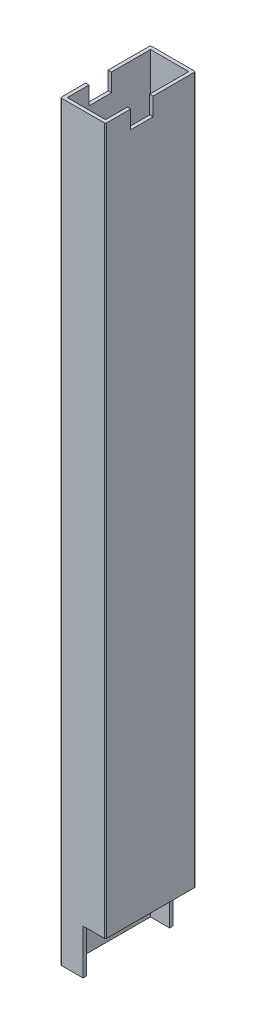
ISO-10303-21;
HEADER;
FILE_DESCRIPTION(('STEP AP214'),'2;1');
FILE_NAME('part.step','',(''),(''),'','','');
FILE_SCHEMA(('AUTOMOTIVE_DESIGN { 1 0 10303 214 1 1 1 1 }'));
ENDSEC;
DATA;
#1=APPLICATION_CONTEXT('core data for automotive mechanical design processes');
#2=APPLICATION_PROTOCOL_DEFINITION('international standard','automotive_design',2000,#1);
#3=PRODUCT_CONTEXT('',#1,'mechanical');
#4=PRODUCT('Part','Part','',(#3));
#5=PRODUCT_RELATED_PRODUCT_CATEGORY('part','',(#4));
#6=PRODUCT_DEFINITION_FORMATION('','',#4);
#7=PRODUCT_DEFINITION_CONTEXT('part definition',#1,'design');
#8=PRODUCT_DEFINITION('design','',#6,#7);
#9=PRODUCT_DEFINITION_SHAPE('','',#8);
#10=(LENGTH_UNIT() NAMED_UNIT(*) SI_UNIT(.MILLI.,.METRE.));
#11=(NAMED_UNIT(*) PLANE_ANGLE_UNIT() SI_UNIT($,.RADIAN.));
#12=(NAMED_UNIT(*) SI_UNIT($,.STERADIAN.) SOLID_ANGLE_UNIT());
#13=UNCERTAINTY_MEASURE_WITH_UNIT(LENGTH_MEASURE(1.E-05),#10,'distance_accuracy_value','');
#14=(GEOMETRIC_REPRESENTATION_CONTEXT(3) GLOBAL_UNCERTAINTY_ASSIGNED_CONTEXT((#13)) GLOBAL_UNIT_ASSIGNED_CONTEXT((#10,
#11,#12)) REPRESENTATION_CONTEXT('',''));
#15=CARTESIAN_POINT('',(0.,0.,0.));
#16=DIRECTION('',(0.,0.,1.));
#17=DIRECTION('',(1.,0.,0.));
#18=AXIS2_PLACEMENT_3D('',#15,#16,#17);
#19=CARTESIAN_POINT('',(19.5,334.,-0.5));
#20=DIRECTION('',(0.,1.,0.));
#21=DIRECTION('',(0.,0.,1.));
#22=AXIS2_PLACEMENT_3D('',#19,#20,#21);
#23=PLANE('',#22);
#24=DIRECTION('',(1.,0.,0.));
#25=VECTOR('',#24,1.);
#26=CARTESIAN_POINT('',(0.,334.,-11.16));
#27=LINE('',#26,#25);
#28=CARTESIAN_POINT('',(0.,334.,-11.16));
#29=VERTEX_POINT('',#28);
#30=CARTESIAN_POINT('',(1.5,334.,-11.16));
#31=VERTEX_POINT('',#30);
#32=EDGE_CURVE('E238',#29,#31,#27,.T.);
#33=ORIENTED_EDGE('',*,*,#32,.F.);
#34=DIRECTION('',(0.,0.,1.));
#35=VECTOR('',#34,1.);
#36=CARTESIAN_POINT('',(0.,334.,-0.500000000000004));
#37=LINE('',#36,#35);
#38=CARTESIAN_POINT('',(0.,334.,-0.500000000000003));
#39=VERTEX_POINT('',#38);
#40=EDGE_CURVE('E222',#29,#39,#37,.T.);
#41=ORIENTED_EDGE('',*,*,#40,.T.);
#42=CARTESIAN_POINT('',(0.5,334.,-0.5));
#43=DIRECTION('',(0.,1.,0.));
#44=DIRECTION('',(0.,0.,-1.));
#45=AXIS2_PLACEMENT_3D('',#42,#43,#44);
#46=CIRCLE('',#45,0.5);
#47=CARTESIAN_POINT('',(0.500000000000004,334.,0.));
#48=VERTEX_POINT('',#47);
#49=EDGE_CURVE('E369',#39,#48,#46,.T.);
#50=ORIENTED_EDGE('',*,*,#49,.T.);
#51=DIRECTION('',(1.,0.,0.));
#52=VECTOR('',#51,1.);
#53=CARTESIAN_POINT('',(0.500000000000004,334.,0.));
#54=LINE('',#53,#52);
#55=CARTESIAN_POINT('',(19.5,334.,0.));
#56=VERTEX_POINT('',#55);
#57=EDGE_CURVE('E372',#48,#56,#54,.T.);
#58=ORIENTED_EDGE('',*,*,#57,.T.);
#59=CARTESIAN_POINT('',(19.5,334.,-0.5));
#60=DIRECTION('',(0.,1.,0.));
#61=DIRECTION('',(0.,0.,1.));
#62=AXIS2_PLACEMENT_3D('',#59,#60,#61);
#63=CIRCLE('',#62,0.5);
#64=CARTESIAN_POINT('',(20.,334.,-0.5));
#65=VERTEX_POINT('',#64);
#66=EDGE_CURVE('E346',#56,#65,#63,.T.);
#67=ORIENTED_EDGE('',*,*,#66,.T.);
#68=DIRECTION('',(0.,0.,-1.));
#69=VECTOR('',#68,1.);
#70=CARTESIAN_POINT('',(20.,334.,-0.5));
#71=LINE('',#70,#69);
#72=CARTESIAN_POINT('',(20.,334.,-11.16));
#73=VERTEX_POINT('',#72);
#74=EDGE_CURVE('E352',#65,#73,#71,.T.);
#75=ORIENTED_EDGE('',*,*,#74,.T.);
#76=CARTESIAN_POINT('',(18.5,334.,-11.16));
#77=VERTEX_POINT('',#76);
#78=EDGE_CURVE('E242',#77,#73,#27,.T.);
#79=ORIENTED_EDGE('',*,*,#78,.F.);
#80=DIRECTION('',(0.,0.,-1.));
#81=VECTOR('',#80,1.);
#82=CARTESIAN_POINT('',(18.5,334.,-1.5));
#83=LINE('',#82,#81);
#84=CARTESIAN_POINT('',(18.5,334.,-1.5));
#85=VERTEX_POINT('',#84);
#86=EDGE_CURVE('E312',#85,#77,#83,.T.);
#87=ORIENTED_EDGE('',*,*,#86,.F.);
#88=DIRECTION('',(1.,0.,0.));
#89=VECTOR('',#88,1.);
#90=CARTESIAN_POINT('',(1.5,334.,-1.5));
#91=LINE('',#90,#89);
#92=CARTESIAN_POINT('',(1.5,334.,-1.5));
#93=VERTEX_POINT('',#92);
#94=EDGE_CURVE('E307',#93,#85,#91,.T.);
#95=ORIENTED_EDGE('',*,*,#94,.F.);
#96=DIRECTION('',(0.,0.,1.));
#97=VECTOR('',#96,1.);
#98=CARTESIAN_POINT('',(1.5,334.,-1.5));
#99=LINE('',#98,#97);
#100=EDGE_CURVE('E308',#31,#93,#99,.T.);
#101=ORIENTED_EDGE('',*,*,#100,.F.);
#102=EDGE_LOOP('',(#33,#41,#50,#58,#67,#75,#79,#87,#95,#101));
#103=FACE_BOUND('',#102,.T.);
#104=ADVANCED_FACE('F39',(#103),#23,.T.);
#105=DIRECTION('',(1.,0.,0.));
#106=VECTOR('',#105,1.);
#107=CARTESIAN_POINT('',(0.,334.,-21.16));
#108=LINE('',#107,#106);
#109=CARTESIAN_POINT('',(18.5,334.,-21.16));
#110=VERTEX_POINT('',#109);
#111=CARTESIAN_POINT('',(20.,334.,-21.16));
#112=VERTEX_POINT('',#111);
#113=EDGE_CURVE('E247',#110,#112,#108,.T.);
#114=ORIENTED_EDGE('',*,*,#113,.T.);
#115=CARTESIAN_POINT('',(20.,334.,-39.5));
#116=VERTEX_POINT('',#115);
#117=EDGE_CURVE('E350',#112,#116,#71,.T.);
#118=ORIENTED_EDGE('',*,*,#117,.T.);
#119=CARTESIAN_POINT('',(19.5,334.,-39.5));
#120=DIRECTION('',(0.,1.,0.));
#121=DIRECTION('',(0.,0.,-1.));
#122=AXIS2_PLACEMENT_3D('',#119,#120,#121);
#123=CIRCLE('',#122,0.5);
#124=CARTESIAN_POINT('',(19.5,334.,-40.));
#125=VERTEX_POINT('',#124);
#126=EDGE_CURVE('E356',#116,#125,#123,.T.);
#127=ORIENTED_EDGE('',*,*,#126,.T.);
#128=DIRECTION('',(-1.,0.,0.));
#129=VECTOR('',#128,1.);
#130=CARTESIAN_POINT('',(0.500000000000004,334.,-40.));
#131=LINE('',#130,#129);
#132=CARTESIAN_POINT('',(0.5,334.,-40.));
#133=VERTEX_POINT('',#132);
#134=EDGE_CURVE('E359',#125,#133,#131,.T.);
#135=ORIENTED_EDGE('',*,*,#134,.T.);
#136=CARTESIAN_POINT('',(0.5,334.,-39.5));
#137=DIRECTION('',(0.,1.,0.));
#138=DIRECTION('',(0.,0.,-1.));
#139=AXIS2_PLACEMENT_3D('',#136,#137,#138);
#140=CIRCLE('',#139,0.5);
#141=CARTESIAN_POINT('',(0.,334.,-39.5));
#142=VERTEX_POINT('',#141);
#143=EDGE_CURVE('E362',#133,#142,#140,.T.);
#144=ORIENTED_EDGE('',*,*,#143,.T.);
#145=CARTESIAN_POINT('',(0.,334.,-21.16));
#146=VERTEX_POINT('',#145);
#147=EDGE_CURVE('E365',#142,#146,#37,.T.);
#148=ORIENTED_EDGE('',*,*,#147,.T.);
#149=CARTESIAN_POINT('',(1.5,334.,-21.16));
#150=VERTEX_POINT('',#149);
#151=EDGE_CURVE('E243',#146,#150,#108,.T.);
#152=ORIENTED_EDGE('',*,*,#151,.T.);
#153=CARTESIAN_POINT('',(1.5,334.,-38.5));
#154=VERTEX_POINT('',#153);
#155=EDGE_CURVE('E303',#154,#150,#99,.T.);
#156=ORIENTED_EDGE('',*,*,#155,.F.);
#157=DIRECTION('',(-1.,0.,0.));
#158=VECTOR('',#157,1.);
#159=CARTESIAN_POINT('',(1.5,334.,-38.5));
#160=LINE('',#159,#158);
#161=CARTESIAN_POINT('',(18.5,334.,-38.5));
#162=VERTEX_POINT('',#161);
#163=EDGE_CURVE('E316',#162,#154,#160,.T.);
#164=ORIENTED_EDGE('',*,*,#163,.F.);
#165=EDGE_CURVE('E311',#110,#162,#83,.T.);
#166=ORIENTED_EDGE('',*,*,#165,.F.);
#167=EDGE_LOOP('',(#114,#118,#127,#135,#144,#148,#152,#156,#164,#166));
#168=FACE_BOUND('',#167,.T.);
#169=ADVANCED_FACE('F481',(#168),#23,.T.);
#170=CARTESIAN_POINT('',(19.5,0.,-0.5));
#171=DIRECTION('',(0.,1.,0.));
#172=DIRECTION('',(0.,0.,1.));
#173=AXIS2_PLACEMENT_3D('',#170,#171,#172);
#174=PLANE('',#173);
#175=DIRECTION('',(-1.,0.,0.));
#176=VECTOR('',#175,1.);
#177=CARTESIAN_POINT('',(0.500000000000004,0.,-40.));
#178=LINE('',#177,#176);
#179=CARTESIAN_POINT('',(10.,0.,-40.));
#180=VERTEX_POINT('',#179);
#181=CARTESIAN_POINT('',(0.5,0.,-40.));
#182=VERTEX_POINT('',#181);
#183=EDGE_CURVE('E345',#180,#182,#178,.T.);
#184=ORIENTED_EDGE('',*,*,#183,.F.);
#185=DIRECTION('',(0.,0.,1.));
#186=VECTOR('',#185,1.);
#187=CARTESIAN_POINT('',(10.,0.,-40.));
#188=LINE('',#187,#186);
#189=CARTESIAN_POINT('',(10.,0.,-38.5));
#190=VERTEX_POINT('',#189);
#191=EDGE_CURVE('E273',#180,#190,#188,.T.);
#192=ORIENTED_EDGE('',*,*,#191,.T.);
#193=DIRECTION('',(-1.,0.,0.));
#194=VECTOR('',#193,1.);
#195=CARTESIAN_POINT('',(1.5,0.,-38.5));
#196=LINE('',#195,#194);
#197=CARTESIAN_POINT('',(1.5,0.,-38.5));
#198=VERTEX_POINT('',#197);
#199=EDGE_CURVE('E327',#190,#198,#196,.T.);
#200=ORIENTED_EDGE('',*,*,#199,.T.);
#201=DIRECTION('',(0.,0.,1.));
#202=VECTOR('',#201,1.);
#203=CARTESIAN_POINT('',(1.5,0.,-1.5));
#204=LINE('',#203,#202);
#205=CARTESIAN_POINT('',(1.5,0.,-1.5));
#206=VERTEX_POINT('',#205);
#207=EDGE_CURVE('E302',#198,#206,#204,.T.);
#208=ORIENTED_EDGE('',*,*,#207,.T.);
#209=DIRECTION('',(1.,0.,0.));
#210=VECTOR('',#209,1.);
#211=CARTESIAN_POINT('',(1.5,0.,-1.5));
#212=LINE('',#211,#210);
#213=CARTESIAN_POINT('',(10.,0.,-1.5));
#214=VERTEX_POINT('',#213);
#215=EDGE_CURVE('E323',#206,#214,#212,.T.);
#216=ORIENTED_EDGE('',*,*,#215,.T.);
#217=CARTESIAN_POINT('',(10.,0.,0.));
#218=VERTEX_POINT('',#217);
#219=EDGE_CURVE('E278',#214,#218,#188,.T.);
#220=ORIENTED_EDGE('',*,*,#219,.T.);
#221=DIRECTION('',(1.,0.,0.));
#222=VECTOR('',#221,1.);
#223=CARTESIAN_POINT('',(0.500000000000004,0.,0.));
#224=LINE('',#223,#222);
#225=CARTESIAN_POINT('',(0.500000000000004,0.,0.));
#226=VERTEX_POINT('',#225);
#227=EDGE_CURVE('E351',#226,#218,#224,.T.);
#228=ORIENTED_EDGE('',*,*,#227,.F.);
#229=CARTESIAN_POINT('',(0.5,0.,-0.5));
#230=DIRECTION('',(0.,1.,0.));
#231=DIRECTION('',(0.,0.,-1.));
#232=AXIS2_PLACEMENT_3D('',#229,#230,#231);
#233=CIRCLE('',#232,0.5);
#234=CARTESIAN_POINT('',(0.,0.,-0.500000000000003));
#235=VERTEX_POINT('',#234);
#236=EDGE_CURVE('E384',#235,#226,#233,.T.);
#237=ORIENTED_EDGE('',*,*,#236,.F.);
#238=DIRECTION('',(0.,0.,1.));
#239=VECTOR('',#238,1.);
#240=CARTESIAN_POINT('',(0.,0.,-0.500000000000004));
#241=LINE('',#240,#239);
#242=CARTESIAN_POINT('',(0.,0.,-39.5));
#243=VERTEX_POINT('',#242);
#244=EDGE_CURVE('E381',#243,#235,#241,.T.);
#245=ORIENTED_EDGE('',*,*,#244,.F.);
#246=CARTESIAN_POINT('',(0.5,0.,-39.5));
#247=DIRECTION('',(0.,1.,0.));
#248=DIRECTION('',(0.,0.,-1.));
#249=AXIS2_PLACEMENT_3D('',#246,#247,#248);
#250=CIRCLE('',#249,0.5);
#251=EDGE_CURVE('E378',#182,#243,#250,.T.);
#252=ORIENTED_EDGE('',*,*,#251,.F.);
#253=EDGE_LOOP('',(#184,#192,#200,#208,#216,#220,#228,#237,#245,#252));
#254=FACE_BOUND('',#253,.T.);
#255=ADVANCED_FACE('F518',(#254),#174,.F.);
#256=CARTESIAN_POINT('',(19.5,334.,-0.5));
#257=DIRECTION('',(0.,-1.,0.));
#258=DIRECTION('',(0.,0.,-1.));
#259=AXIS2_PLACEMENT_3D('',#256,#257,#258);
#260=CYLINDRICAL_SURFACE('',#259,0.5);
#261=DIRECTION('',(0.,-1.,0.));
#262=VECTOR('',#261,1.);
#263=CARTESIAN_POINT('',(19.5,334.,0.));
#264=LINE('',#263,#262);
#265=CARTESIAN_POINT('',(19.5,20.,0.));
#266=VERTEX_POINT('',#265);
#267=EDGE_CURVE('E375',#56,#266,#264,.T.);
#268=ORIENTED_EDGE('',*,*,#267,.T.);
#269=CARTESIAN_POINT('',(19.5,20.,-0.5));
#270=DIRECTION('',(0.,1.,0.));
#271=DIRECTION('',(0.,0.,1.));
#272=AXIS2_PLACEMENT_3D('',#269,#270,#271);
#273=CIRCLE('',#272,0.5);
#274=CARTESIAN_POINT('',(20.,20.,-0.5));
#275=VERTEX_POINT('',#274);
#276=EDGE_CURVE('E295',#266,#275,#273,.T.);
#277=ORIENTED_EDGE('',*,*,#276,.T.);
#278=DIRECTION('',(0.,-1.,0.));
#279=VECTOR('',#278,1.);
#280=CARTESIAN_POINT('',(20.,334.,-0.5));
#281=LINE('',#280,#279);
#282=EDGE_CURVE('E417',#65,#275,#281,.T.);
#283=ORIENTED_EDGE('',*,*,#282,.F.);
#284=ORIENTED_EDGE('',*,*,#66,.F.);
#285=EDGE_LOOP('',(#268,#277,#283,#284));
#286=FACE_BOUND('',#285,.T.);
#287=ADVANCED_FACE('F41',(#286),#260,.T.);
#288=CARTESIAN_POINT('',(20.,334.,-0.5));
#289=DIRECTION('',(-1.,0.,0.));
#290=DIRECTION('',(0.,0.,1.));
#291=AXIS2_PLACEMENT_3D('',#288,#289,#290);
#292=PLANE('',#291);
#293=DIRECTION('',(0.,0.,-1.));
#294=VECTOR('',#293,1.);
#295=CARTESIAN_POINT('',(20.,326.,-11.16));
#296=LINE('',#295,#294);
#297=CARTESIAN_POINT('',(20.,326.,-11.16));
#298=VERTEX_POINT('',#297);
#299=CARTESIAN_POINT('',(20.,326.,-21.16));
#300=VERTEX_POINT('',#299);
#301=EDGE_CURVE('E227',#298,#300,#296,.T.);
#302=ORIENTED_EDGE('',*,*,#301,.F.);
#303=DIRECTION('',(0.,-1.,0.));
#304=VECTOR('',#303,1.);
#305=CARTESIAN_POINT('',(20.,334.,-11.16));
#306=LINE('',#305,#304);
#307=EDGE_CURVE('E232',#73,#298,#306,.T.);
#308=ORIENTED_EDGE('',*,*,#307,.F.);
#309=ORIENTED_EDGE('',*,*,#74,.F.);
#310=ORIENTED_EDGE('',*,*,#282,.T.);
#311=DIRECTION('',(0.,0.,1.));
#312=VECTOR('',#311,1.);
#313=CARTESIAN_POINT('',(20.,20.,-40.));
#314=LINE('',#313,#312);
#315=CARTESIAN_POINT('',(20.,20.,-39.5));
#316=VERTEX_POINT('',#315);
#317=EDGE_CURVE('E267',#316,#275,#314,.T.);
#318=ORIENTED_EDGE('',*,*,#317,.F.);
#319=DIRECTION('',(0.,-1.,0.));
#320=VECTOR('',#319,1.);
#321=CARTESIAN_POINT('',(20.,334.,-39.5));
#322=LINE('',#321,#320);
#323=EDGE_CURVE('E413',#116,#316,#322,.T.);
#324=ORIENTED_EDGE('',*,*,#323,.F.);
#325=ORIENTED_EDGE('',*,*,#117,.F.);
#326=DIRECTION('',(0.,1.,0.));
#327=VECTOR('',#326,1.);
#328=CARTESIAN_POINT('',(20.,334.,-21.16));
#329=LINE('',#328,#327);
#330=EDGE_CURVE('E224',#300,#112,#329,.T.);
#331=ORIENTED_EDGE('',*,*,#330,.F.);
#332=EDGE_LOOP('',(#302,#308,#309,#310,#318,#324,#325,#331));
#333=FACE_BOUND('',#332,.T.);
#334=ADVANCED_FACE('F476',(#333),#292,.F.);
#335=CARTESIAN_POINT('',(19.5,334.,-39.5));
#336=DIRECTION('',(0.,-1.,0.));
#337=DIRECTION('',(0.,0.,-1.));
#338=AXIS2_PLACEMENT_3D('',#335,#336,#337);
#339=CYLINDRICAL_SURFACE('',#338,0.5);
#340=ORIENTED_EDGE('',*,*,#323,.T.);
#341=CARTESIAN_POINT('',(19.5,20.,-39.5));
#342=DIRECTION('',(0.,1.,0.));
#343=DIRECTION('',(0.,0.,1.));
#344=AXIS2_PLACEMENT_3D('',#341,#342,#343);
#345=CIRCLE('',#344,0.5);
#346=CARTESIAN_POINT('',(19.5,20.,-40.));
#347=VERTEX_POINT('',#346);
#348=EDGE_CURVE('E291',#316,#347,#345,.T.);
#349=ORIENTED_EDGE('',*,*,#348,.T.);
#350=DIRECTION('',(0.,-1.,0.));
#351=VECTOR('',#350,1.);
#352=CARTESIAN_POINT('',(19.5,334.,-40.));
#353=LINE('',#352,#351);
#354=EDGE_CURVE('E409',#125,#347,#353,.T.);
#355=ORIENTED_EDGE('',*,*,#354,.F.);
#356=ORIENTED_EDGE('',*,*,#126,.F.);
#357=EDGE_LOOP('',(#340,#349,#355,#356));
#358=FACE_BOUND('',#357,.T.);
#359=ADVANCED_FACE('F503',(#358),#339,.T.);
#360=CARTESIAN_POINT('',(0.500000000000004,334.,-40.));
#361=DIRECTION('',(0.,0.,1.));
#362=DIRECTION('',(1.,0.,0.));
#363=AXIS2_PLACEMENT_3D('',#360,#361,#362);
#364=PLANE('',#363);
#365=DIRECTION('',(-1.,0.,0.));
#366=VECTOR('',#365,1.);
#367=CARTESIAN_POINT('',(20.,20.,-40.));
#368=LINE('',#367,#366);
#369=CARTESIAN_POINT('',(10.,20.,-40.));
#370=VERTEX_POINT('',#369);
#371=EDGE_CURVE('E258',#347,#370,#368,.T.);
#372=ORIENTED_EDGE('',*,*,#371,.T.);
#373=DIRECTION('',(0.,-1.,0.));
#374=VECTOR('',#373,1.);
#375=CARTESIAN_POINT('',(10.,20.,-40.));
#376=LINE('',#375,#374);
#377=EDGE_CURVE('E262',#370,#180,#376,.T.);
#378=ORIENTED_EDGE('',*,*,#377,.T.);
#379=ORIENTED_EDGE('',*,*,#183,.T.);
#380=DIRECTION('',(0.,-1.,0.));
#381=VECTOR('',#380,1.);
#382=CARTESIAN_POINT('',(0.5,334.,-40.));
#383=LINE('',#382,#381);
#384=EDGE_CURVE('E405',#133,#182,#383,.T.);
#385=ORIENTED_EDGE('',*,*,#384,.F.);
#386=ORIENTED_EDGE('',*,*,#134,.F.);
#387=ORIENTED_EDGE('',*,*,#354,.T.);
#388=EDGE_LOOP('',(#372,#378,#379,#385,#386,#387));
#389=FACE_BOUND('',#388,.T.);
#390=ADVANCED_FACE('F499',(#389),#364,.F.);
#391=CARTESIAN_POINT('',(0.5,334.,-39.5));
#392=DIRECTION('',(0.,-1.,0.));
#393=DIRECTION('',(0.,0.,-1.));
#394=AXIS2_PLACEMENT_3D('',#391,#392,#393);
#395=CYLINDRICAL_SURFACE('',#394,0.5);
#396=ORIENTED_EDGE('',*,*,#251,.T.);
#397=DIRECTION('',(0.,-1.,0.));
#398=VECTOR('',#397,1.);
#399=CARTESIAN_POINT('',(0.,334.,-39.5));
#400=LINE('',#399,#398);
#401=EDGE_CURVE('E401',#142,#243,#400,.T.);
#402=ORIENTED_EDGE('',*,*,#401,.F.);
#403=ORIENTED_EDGE('',*,*,#143,.F.);
#404=ORIENTED_EDGE('',*,*,#384,.T.);
#405=EDGE_LOOP('',(#396,#402,#403,#404));
#406=FACE_BOUND('',#405,.T.);
#407=ADVANCED_FACE('F510',(#406),#395,.T.);
#408=CARTESIAN_POINT('',(0.,334.,-0.500000000000004));
#409=DIRECTION('',(1.,0.,0.));
#410=DIRECTION('',(0.,0.,-1.));
#411=AXIS2_PLACEMENT_3D('',#408,#409,#410);
#412=PLANE('',#411);
#413=ORIENTED_EDGE('',*,*,#40,.F.);
#414=DIRECTION('',(0.,-1.,0.));
#415=VECTOR('',#414,1.);
#416=CARTESIAN_POINT('',(0.,334.,-11.16));
#417=LINE('',#416,#415);
#418=CARTESIAN_POINT('',(0.,326.,-11.16));
#419=VERTEX_POINT('',#418);
#420=EDGE_CURVE('E200',#29,#419,#417,.T.);
#421=ORIENTED_EDGE('',*,*,#420,.T.);
#422=DIRECTION('',(0.,0.,-1.));
#423=VECTOR('',#422,1.);
#424=CARTESIAN_POINT('',(0.,326.,-11.16));
#425=LINE('',#424,#423);
#426=CARTESIAN_POINT('',(0.,326.,-21.16));
#427=VERTEX_POINT('',#426);
#428=EDGE_CURVE('E209',#419,#427,#425,.T.);
#429=ORIENTED_EDGE('',*,*,#428,.T.);
#430=DIRECTION('',(0.,1.,0.));
#431=VECTOR('',#430,1.);
#432=CARTESIAN_POINT('',(0.,334.,-21.16));
#433=LINE('',#432,#431);
#434=EDGE_CURVE('E217',#427,#146,#433,.T.);
#435=ORIENTED_EDGE('',*,*,#434,.T.);
#436=ORIENTED_EDGE('',*,*,#147,.F.);
#437=ORIENTED_EDGE('',*,*,#401,.T.);
#438=ORIENTED_EDGE('',*,*,#244,.T.);
#439=DIRECTION('',(0.,-1.,0.));
#440=VECTOR('',#439,1.);
#441=CARTESIAN_POINT('',(0.,334.,-0.500000000000003));
#442=LINE('',#441,#440);
#443=EDGE_CURVE('E397',#39,#235,#442,.T.);
#444=ORIENTED_EDGE('',*,*,#443,.F.);
#445=EDGE_LOOP('',(#413,#421,#429,#435,#436,#437,#438,#444));
#446=FACE_BOUND('',#445,.T.);
#447=ADVANCED_FACE('F220',(#446),#412,.F.);
#448=CARTESIAN_POINT('',(0.5,334.,-0.5));
#449=DIRECTION('',(0.,-1.,0.));
#450=DIRECTION('',(0.,0.,-1.));
#451=AXIS2_PLACEMENT_3D('',#448,#449,#450);
#452=CYLINDRICAL_SURFACE('',#451,0.5);
#453=ORIENTED_EDGE('',*,*,#236,.T.);
#454=DIRECTION('',(0.,-1.,0.));
#455=VECTOR('',#454,1.);
#456=CARTESIAN_POINT('',(0.500000000000004,334.,0.));
#457=LINE('',#456,#455);
#458=EDGE_CURVE('E393',#48,#226,#457,.T.);
#459=ORIENTED_EDGE('',*,*,#458,.F.);
#460=ORIENTED_EDGE('',*,*,#49,.F.);
#461=ORIENTED_EDGE('',*,*,#443,.T.);
#462=EDGE_LOOP('',(#453,#459,#460,#461));
#463=FACE_BOUND('',#462,.T.);
#464=ADVANCED_FACE('F464',(#463),#452,.T.);
#465=CARTESIAN_POINT('',(0.500000000000004,334.,0.));
#466=DIRECTION('',(0.,0.,-1.));
#467=DIRECTION('',(-1.,0.,0.));
#468=AXIS2_PLACEMENT_3D('',#465,#466,#467);
#469=PLANE('',#468);
#470=ORIENTED_EDGE('',*,*,#227,.T.);
#471=DIRECTION('',(0.,-1.,0.));
#472=VECTOR('',#471,1.);
#473=CARTESIAN_POINT('',(10.,20.,0.));
#474=LINE('',#473,#472);
#475=CARTESIAN_POINT('',(10.,20.,0.));
#476=VERTEX_POINT('',#475);
#477=EDGE_CURVE('E263',#476,#218,#474,.T.);
#478=ORIENTED_EDGE('',*,*,#477,.F.);
#479=DIRECTION('',(-1.,0.,0.));
#480=VECTOR('',#479,1.);
#481=CARTESIAN_POINT('',(20.,20.,0.));
#482=LINE('',#481,#480);
#483=EDGE_CURVE('E257',#266,#476,#482,.T.);
#484=ORIENTED_EDGE('',*,*,#483,.F.);
#485=ORIENTED_EDGE('',*,*,#267,.F.);
#486=ORIENTED_EDGE('',*,*,#57,.F.);
#487=ORIENTED_EDGE('',*,*,#458,.T.);
#488=EDGE_LOOP('',(#470,#478,#484,#485,#486,#487));
#489=FACE_BOUND('',#488,.T.);
#490=ADVANCED_FACE('F469',(#489),#469,.F.);
#491=CARTESIAN_POINT('',(1.5,334.,-1.5));
#492=DIRECTION('',(1.,0.,0.));
#493=DIRECTION('',(0.,0.,-1.));
#494=AXIS2_PLACEMENT_3D('',#491,#492,#493);
#495=PLANE('',#494);
#496=DIRECTION('',(0.,-1.,0.));
#497=VECTOR('',#496,1.);
#498=CARTESIAN_POINT('',(1.5,334.,-11.16));
#499=LINE('',#498,#497);
#500=CARTESIAN_POINT('',(1.5,326.,-11.16));
#501=VERTEX_POINT('',#500);
#502=EDGE_CURVE('E203',#31,#501,#499,.T.);
#503=ORIENTED_EDGE('',*,*,#502,.F.);
#504=ORIENTED_EDGE('',*,*,#100,.T.);
#505=DIRECTION('',(0.,-1.,0.));
#506=VECTOR('',#505,1.);
#507=CARTESIAN_POINT('',(1.5,334.,-1.5));
#508=LINE('',#507,#506);
#509=EDGE_CURVE('E341',#93,#206,#508,.T.);
#510=ORIENTED_EDGE('',*,*,#509,.T.);
#511=ORIENTED_EDGE('',*,*,#207,.F.);
#512=DIRECTION('',(0.,-1.,0.));
#513=VECTOR('',#512,1.);
#514=CARTESIAN_POINT('',(1.5,334.,-38.5));
#515=LINE('',#514,#513);
#516=EDGE_CURVE('E319',#154,#198,#515,.T.);
#517=ORIENTED_EDGE('',*,*,#516,.F.);
#518=ORIENTED_EDGE('',*,*,#155,.T.);
#519=DIRECTION('',(0.,1.,0.));
#520=VECTOR('',#519,1.);
#521=CARTESIAN_POINT('',(1.5,334.,-21.16));
#522=LINE('',#521,#520);
#523=CARTESIAN_POINT('',(1.5,326.,-21.16));
#524=VERTEX_POINT('',#523);
#525=EDGE_CURVE('E252',#524,#150,#522,.T.);
#526=ORIENTED_EDGE('',*,*,#525,.F.);
#527=DIRECTION('',(0.,0.,-1.));
#528=VECTOR('',#527,1.);
#529=CARTESIAN_POINT('',(1.5,326.,-1.5));
#530=LINE('',#529,#528);
#531=EDGE_CURVE('E241',#501,#524,#530,.T.);
#532=ORIENTED_EDGE('',*,*,#531,.F.);
#533=EDGE_LOOP('',(#503,#504,#510,#511,#517,#518,#526,#532));
#534=FACE_BOUND('',#533,.T.);
#535=ADVANCED_FACE('F515',(#534),#495,.T.);
#536=CARTESIAN_POINT('',(1.5,334.,-1.5));
#537=DIRECTION('',(0.,0.,-1.));
#538=DIRECTION('',(-1.,0.,0.));
#539=AXIS2_PLACEMENT_3D('',#536,#537,#538);
#540=PLANE('',#539);
#541=DIRECTION('',(0.,1.,0.));
#542=VECTOR('',#541,1.);
#543=CARTESIAN_POINT('',(10.,334.,-1.5));
#544=LINE('',#543,#542);
#545=CARTESIAN_POINT('',(10.,20.,-1.5));
#546=VERTEX_POINT('',#545);
#547=EDGE_CURVE('E299',#214,#546,#544,.T.);
#548=ORIENTED_EDGE('',*,*,#547,.F.);
#549=ORIENTED_EDGE('',*,*,#215,.F.);
#550=ORIENTED_EDGE('',*,*,#509,.F.);
#551=ORIENTED_EDGE('',*,*,#94,.T.);
#552=DIRECTION('',(0.,-1.,0.));
#553=VECTOR('',#552,1.);
#554=CARTESIAN_POINT('',(18.5,334.,-1.5));
#555=LINE('',#554,#553);
#556=CARTESIAN_POINT('',(18.5,20.,-1.5));
#557=VERTEX_POINT('',#556);
#558=EDGE_CURVE('E337',#85,#557,#555,.T.);
#559=ORIENTED_EDGE('',*,*,#558,.T.);
#560=DIRECTION('',(1.,0.,0.));
#561=VECTOR('',#560,1.);
#562=CARTESIAN_POINT('',(1.5,20.,-1.5));
#563=LINE('',#562,#561);
#564=EDGE_CURVE('E288',#546,#557,#563,.T.);
#565=ORIENTED_EDGE('',*,*,#564,.F.);
#566=EDGE_LOOP('',(#548,#549,#550,#551,#559,#565));
#567=FACE_BOUND('',#566,.T.);
#568=ADVANCED_FACE('F526',(#567),#540,.T.);
#569=CARTESIAN_POINT('',(18.5,334.,-1.5));
#570=DIRECTION('',(-1.,0.,0.));
#571=DIRECTION('',(0.,0.,1.));
#572=AXIS2_PLACEMENT_3D('',#569,#570,#571);
#573=PLANE('',#572);
#574=DIRECTION('',(0.,1.,0.));
#575=VECTOR('',#574,1.);
#576=CARTESIAN_POINT('',(18.5,334.,-11.16));
#577=LINE('',#576,#575);
#578=CARTESIAN_POINT('',(18.5,326.,-11.16));
#579=VERTEX_POINT('',#578);
#580=EDGE_CURVE('E11',#579,#77,#577,.T.);
#581=ORIENTED_EDGE('',*,*,#580,.F.);
#582=DIRECTION('',(0.,0.,1.));
#583=VECTOR('',#582,1.);
#584=CARTESIAN_POINT('',(18.5,326.,-1.5));
#585=LINE('',#584,#583);
#586=CARTESIAN_POINT('',(18.5,326.,-21.16));
#587=VERTEX_POINT('',#586);
#588=EDGE_CURVE('E427',#587,#579,#585,.T.);
#589=ORIENTED_EDGE('',*,*,#588,.F.);
#590=DIRECTION('',(0.,-1.,0.));
#591=VECTOR('',#590,1.);
#592=CARTESIAN_POINT('',(18.5,334.,-21.16));
#593=LINE('',#592,#591);
#594=EDGE_CURVE('E48',#110,#587,#593,.T.);
#595=ORIENTED_EDGE('',*,*,#594,.F.);
#596=ORIENTED_EDGE('',*,*,#165,.T.);
#597=DIRECTION('',(0.,-1.,0.));
#598=VECTOR('',#597,1.);
#599=CARTESIAN_POINT('',(18.5,334.,-38.5));
#600=LINE('',#599,#598);
#601=CARTESIAN_POINT('',(18.5,20.0000000000001,-38.5));
#602=VERTEX_POINT('',#601);
#603=EDGE_CURVE('E333',#162,#602,#600,.T.);
#604=ORIENTED_EDGE('',*,*,#603,.T.);
#605=DIRECTION('',(0.,0.,-1.));
#606=VECTOR('',#605,1.);
#607=CARTESIAN_POINT('',(18.5,20.,-1.5));
#608=LINE('',#607,#606);
#609=EDGE_CURVE('E277',#557,#602,#608,.T.);
#610=ORIENTED_EDGE('',*,*,#609,.F.);
#611=ORIENTED_EDGE('',*,*,#558,.F.);
#612=ORIENTED_EDGE('',*,*,#86,.T.);
#613=EDGE_LOOP('',(#581,#589,#595,#596,#604,#610,#611,#612));
#614=FACE_BOUND('',#613,.T.);
#615=ADVANCED_FACE('F438',(#614),#573,.T.);
#616=CARTESIAN_POINT('',(1.5,334.,-38.5));
#617=DIRECTION('',(0.,0.,1.));
#618=DIRECTION('',(1.,0.,0.));
#619=AXIS2_PLACEMENT_3D('',#616,#617,#618);
#620=PLANE('',#619);
#621=DIRECTION('',(0.,-1.,0.));
#622=VECTOR('',#621,1.);
#623=CARTESIAN_POINT('',(10.,334.,-38.5));
#624=LINE('',#623,#622);
#625=CARTESIAN_POINT('',(10.,20.,-38.5));
#626=VERTEX_POINT('',#625);
#627=EDGE_CURVE('E424',#626,#190,#624,.T.);
#628=ORIENTED_EDGE('',*,*,#627,.F.);
#629=DIRECTION('',(-1.,0.,0.));
#630=VECTOR('',#629,1.);
#631=CARTESIAN_POINT('',(1.5,20.,-38.5));
#632=LINE('',#631,#630);
#633=EDGE_CURVE('E421',#602,#626,#632,.T.);
#634=ORIENTED_EDGE('',*,*,#633,.F.);
#635=ORIENTED_EDGE('',*,*,#603,.F.);
#636=ORIENTED_EDGE('',*,*,#163,.T.);
#637=ORIENTED_EDGE('',*,*,#516,.T.);
#638=ORIENTED_EDGE('',*,*,#199,.F.);
#639=EDGE_LOOP('',(#628,#634,#635,#636,#637,#638));
#640=FACE_BOUND('',#639,.T.);
#641=ADVANCED_FACE('F489',(#640),#620,.T.);
#642=CARTESIAN_POINT('',(10.,20.,-40.));
#643=DIRECTION('',(-1.,0.,0.));
#644=DIRECTION('',(0.,0.,1.));
#645=AXIS2_PLACEMENT_3D('',#642,#643,#644);
#646=PLANE('',#645);
#647=ORIENTED_EDGE('',*,*,#547,.T.);
#648=DIRECTION('',(0.,0.,1.));
#649=VECTOR('',#648,1.);
#650=CARTESIAN_POINT('',(10.,20.,-40.));
#651=LINE('',#650,#649);
#652=EDGE_CURVE('E283',#546,#476,#651,.T.);
#653=ORIENTED_EDGE('',*,*,#652,.T.);
#654=ORIENTED_EDGE('',*,*,#477,.T.);
#655=ORIENTED_EDGE('',*,*,#219,.F.);
#656=EDGE_LOOP('',(#647,#653,#654,#655));
#657=FACE_BOUND('',#656,.T.);
#658=ADVANCED_FACE('F521',(#657),#646,.F.);
#659=CARTESIAN_POINT('',(20.,20.,-40.));
#660=DIRECTION('',(0.,1.,0.));
#661=DIRECTION('',(0.,0.,1.));
#662=AXIS2_PLACEMENT_3D('',#659,#660,#661);
#663=PLANE('',#662);
#664=ORIENTED_EDGE('',*,*,#483,.T.);
#665=ORIENTED_EDGE('',*,*,#652,.F.);
#666=ORIENTED_EDGE('',*,*,#564,.T.);
#667=ORIENTED_EDGE('',*,*,#609,.T.);
#668=ORIENTED_EDGE('',*,*,#633,.T.);
#669=EDGE_CURVE('E279',#370,#626,#651,.T.);
#670=ORIENTED_EDGE('',*,*,#669,.F.);
#671=ORIENTED_EDGE('',*,*,#371,.F.);
#672=ORIENTED_EDGE('',*,*,#348,.F.);
#673=ORIENTED_EDGE('',*,*,#317,.T.);
#674=ORIENTED_EDGE('',*,*,#276,.F.);
#675=EDGE_LOOP('',(#664,#665,#666,#667,#668,#670,#671,#672,#673,#674));
#676=FACE_BOUND('',#675,.T.);
#677=ADVANCED_FACE('F493',(#676),#663,.F.);
#678=ORIENTED_EDGE('',*,*,#627,.T.);
#679=ORIENTED_EDGE('',*,*,#191,.F.);
#680=ORIENTED_EDGE('',*,*,#377,.F.);
#681=ORIENTED_EDGE('',*,*,#669,.T.);
#682=EDGE_LOOP('',(#678,#679,#680,#681));
#683=FACE_BOUND('',#682,.T.);
#684=ADVANCED_FACE('F496',(#683),#646,.F.);
#685=CARTESIAN_POINT('',(0.,326.,-11.16));
#686=DIRECTION('',(0.,-1.,0.));
#687=DIRECTION('',(0.,0.,-1.));
#688=AXIS2_PLACEMENT_3D('',#685,#686,#687);
#689=PLANE('',#688);
#690=ORIENTED_EDGE('',*,*,#588,.T.);
#691=DIRECTION('',(1.,0.,0.));
#692=VECTOR('',#691,1.);
#693=CARTESIAN_POINT('',(0.,326.,-11.16));
#694=LINE('',#693,#692);
#695=EDGE_CURVE('E206',#579,#298,#694,.T.);
#696=ORIENTED_EDGE('',*,*,#695,.T.);
#697=ORIENTED_EDGE('',*,*,#301,.T.);
#698=DIRECTION('',(1.,0.,0.));
#699=VECTOR('',#698,1.);
#700=CARTESIAN_POINT('',(0.,326.,-21.16));
#701=LINE('',#700,#699);
#702=EDGE_CURVE('E63',#587,#300,#701,.T.);
#703=ORIENTED_EDGE('',*,*,#702,.F.);
#704=EDGE_LOOP('',(#690,#696,#697,#703));
#705=FACE_BOUND('',#704,.T.);
#706=ADVANCED_FACE('F440',(#705),#689,.F.);
#707=CARTESIAN_POINT('',(0.,334.,-21.16));
#708=DIRECTION('',(0.,0.,-1.));
#709=DIRECTION('',(-1.,0.,0.));
#710=AXIS2_PLACEMENT_3D('',#707,#708,#709);
#711=PLANE('',#710);
#712=ORIENTED_EDGE('',*,*,#594,.T.);
#713=ORIENTED_EDGE('',*,*,#702,.T.);
#714=ORIENTED_EDGE('',*,*,#330,.T.);
#715=ORIENTED_EDGE('',*,*,#113,.F.);
#716=EDGE_LOOP('',(#712,#713,#714,#715));
#717=FACE_BOUND('',#716,.T.);
#718=ADVANCED_FACE('F433',(#717),#711,.F.);
#719=CARTESIAN_POINT('',(0.,334.,-11.16));
#720=DIRECTION('',(0.,0.,1.));
#721=DIRECTION('',(0.,-1.,0.));
#722=AXIS2_PLACEMENT_3D('',#719,#720,#721);
#723=PLANE('',#722);
#724=ORIENTED_EDGE('',*,*,#580,.T.);
#725=ORIENTED_EDGE('',*,*,#78,.T.);
#726=ORIENTED_EDGE('',*,*,#307,.T.);
#727=ORIENTED_EDGE('',*,*,#695,.F.);
#728=EDGE_LOOP('',(#724,#725,#726,#727));
#729=FACE_BOUND('',#728,.T.);
#730=ADVANCED_FACE('F442',(#729),#723,.F.);
#731=ORIENTED_EDGE('',*,*,#502,.T.);
#732=EDGE_CURVE('E55',#419,#501,#694,.T.);
#733=ORIENTED_EDGE('',*,*,#732,.F.);
#734=ORIENTED_EDGE('',*,*,#420,.F.);
#735=ORIENTED_EDGE('',*,*,#32,.T.);
#736=EDGE_LOOP('',(#731,#733,#734,#735));
#737=FACE_BOUND('',#736,.T.);
#738=ADVANCED_FACE('F198',(#737),#723,.F.);
#739=ORIENTED_EDGE('',*,*,#525,.T.);
#740=ORIENTED_EDGE('',*,*,#151,.F.);
#741=ORIENTED_EDGE('',*,*,#434,.F.);
#742=EDGE_CURVE('E212',#427,#524,#701,.T.);
#743=ORIENTED_EDGE('',*,*,#742,.T.);
#744=EDGE_LOOP('',(#739,#740,#741,#743));
#745=FACE_BOUND('',#744,.T.);
#746=ADVANCED_FACE('F531',(#745),#711,.F.);
#747=ORIENTED_EDGE('',*,*,#531,.T.);
#748=ORIENTED_EDGE('',*,*,#742,.F.);
#749=ORIENTED_EDGE('',*,*,#428,.F.);
#750=ORIENTED_EDGE('',*,*,#732,.T.);
#751=EDGE_LOOP('',(#747,#748,#749,#750));
#752=FACE_BOUND('',#751,.T.);
#753=ADVANCED_FACE('F210',(#752),#689,.F.);
#754=CLOSED_SHELL('',(#104,#169,#255,#287,#334,#359,#390,#407,#447,#464,#490,#535,#568,#615,
#641,#658,#677,#684,#706,#718,#730,#738,#746,#753));
#755=MANIFOLD_SOLID_BREP('B2',#754);
#756=ADVANCED_BREP_SHAPE_REPRESENTATION('',(#18,#755),#14);
#757=SHAPE_DEFINITION_REPRESENTATION(#9,#756);
ENDSEC;
END-ISO-10303-21;
